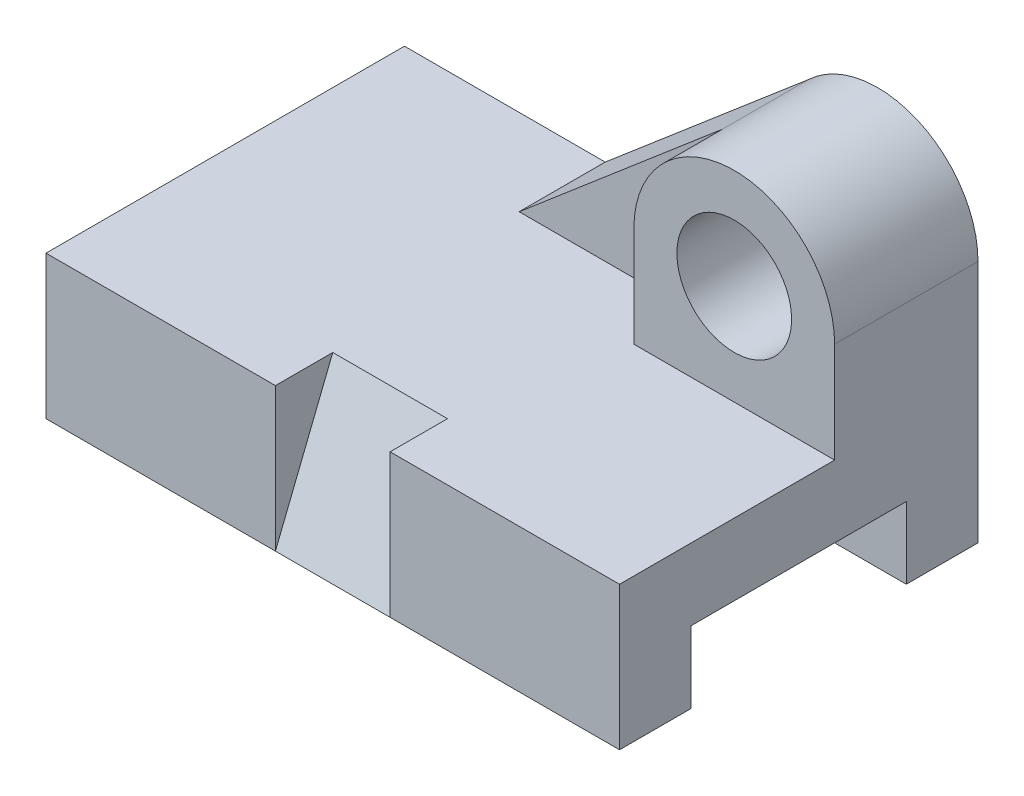
ISO-10303-21;
HEADER;
FILE_DESCRIPTION(('STEP AP214'),'2;1');
FILE_NAME('part.step','',(''),(''),'','','');
FILE_SCHEMA(('AUTOMOTIVE_DESIGN { 1 0 10303 214 1 1 1 1 }'));
ENDSEC;
DATA;
#1=APPLICATION_CONTEXT('core data for automotive mechanical design processes');
#2=APPLICATION_PROTOCOL_DEFINITION('international standard','automotive_design',2000,#1);
#3=PRODUCT_CONTEXT('',#1,'mechanical');
#4=PRODUCT('Part','Part','',(#3));
#5=PRODUCT_RELATED_PRODUCT_CATEGORY('part','',(#4));
#6=PRODUCT_DEFINITION_FORMATION('','',#4);
#7=PRODUCT_DEFINITION_CONTEXT('part definition',#1,'design');
#8=PRODUCT_DEFINITION('design','',#6,#7);
#9=PRODUCT_DEFINITION_SHAPE('','',#8);
#10=(LENGTH_UNIT() NAMED_UNIT(*) SI_UNIT(.MILLI.,.METRE.));
#11=(NAMED_UNIT(*) PLANE_ANGLE_UNIT() SI_UNIT($,.RADIAN.));
#12=(NAMED_UNIT(*) SI_UNIT($,.STERADIAN.) SOLID_ANGLE_UNIT());
#13=UNCERTAINTY_MEASURE_WITH_UNIT(LENGTH_MEASURE(1.E-05),#10,'distance_accuracy_value','');
#14=(GEOMETRIC_REPRESENTATION_CONTEXT(3) GLOBAL_UNCERTAINTY_ASSIGNED_CONTEXT((#13)) GLOBAL_UNIT_ASSIGNED_CONTEXT((#10,
#11,#12)) REPRESENTATION_CONTEXT('',''));
#15=CARTESIAN_POINT('',(0.,0.,0.));
#16=DIRECTION('',(0.,0.,1.));
#17=DIRECTION('',(1.,0.,0.));
#18=AXIS2_PLACEMENT_3D('',#15,#16,#17);
#19=CARTESIAN_POINT('',(42.0289855072463,85.,-5.07246376811594));
#20=DIRECTION('',(-1.,0.,0.));
#21=DIRECTION('',(0.,0.,1.));
#22=AXIS2_PLACEMENT_3D('',#19,#20,#21);
#23=PLANE('',#22);
#24=DIRECTION('',(0.,0.,-1.));
#25=VECTOR('',#24,1.);
#26=CARTESIAN_POINT('',(42.0289855072463,85.,-5.07246376811594));
#27=LINE('',#26,#25);
#28=CARTESIAN_POINT('',(42.0289855072463,85.,-5.07246376811594));
#29=VERTEX_POINT('',#28);
#30=CARTESIAN_POINT('',(42.0289855072463,85.,-25.0724637681159));
#31=VERTEX_POINT('',#30);
#32=EDGE_CURVE('E213',#29,#31,#27,.T.);
#33=ORIENTED_EDGE('',*,*,#32,.T.);
#34=DIRECTION('',(0.,1.,0.));
#35=VECTOR('',#34,1.);
#36=CARTESIAN_POINT('',(42.0289855072463,0.,-25.0724637681159));
#37=LINE('',#36,#35);
#38=CARTESIAN_POINT('',(42.0289855072463,50.,-25.0724637681159));
#39=VERTEX_POINT('',#38);
#40=EDGE_CURVE('E171',#39,#31,#37,.T.);
#41=ORIENTED_EDGE('',*,*,#40,.F.);
#42=DIRECTION('',(0.,0.,-1.));
#43=VECTOR('',#42,1.);
#44=CARTESIAN_POINT('',(42.0289855072463,50.,-5.07246376811594));
#45=LINE('',#44,#43);
#46=CARTESIAN_POINT('',(42.0289855072463,50.,-5.07246376811594));
#47=VERTEX_POINT('',#46);
#48=EDGE_CURVE('E183',#47,#39,#45,.T.);
#49=ORIENTED_EDGE('',*,*,#48,.F.);
#50=DIRECTION('',(0.,1.,0.));
#51=VECTOR('',#50,1.);
#52=CARTESIAN_POINT('',(42.0289855072463,85.,-5.07246376811594));
#53=LINE('',#52,#51);
#54=EDGE_CURVE('E202',#47,#29,#53,.T.);
#55=ORIENTED_EDGE('',*,*,#54,.T.);
#56=EDGE_LOOP('',(#33,#41,#49,#55));
#57=FACE_BOUND('',#56,.T.);
#58=ADVANCED_FACE('F39',(#57),#23,.T.);
#59=CARTESIAN_POINT('',(0.,50.,0.));
#60=DIRECTION('',(0.,1.,0.));
#61=DIRECTION('',(0.,0.,1.));
#62=AXIS2_PLACEMENT_3D('',#59,#60,#61);
#63=PLANE('',#62);
#64=DIRECTION('',(0.,0.,-1.));
#65=VECTOR('',#64,1.);
#66=CARTESIAN_POINT('',(-17.9710144927537,50.,-25.0724637681159));
#67=LINE('',#66,#65);
#68=CARTESIAN_POINT('',(-17.9710144927537,50.,-25.0724637681159));
#69=VERTEX_POINT('',#68);
#70=CARTESIAN_POINT('',(-17.9710144927537,50.,-55.0724637681159));
#71=VERTEX_POINT('',#70);
#72=EDGE_CURVE('E162',#69,#71,#67,.T.);
#73=ORIENTED_EDGE('',*,*,#72,.T.);
#74=DIRECTION('',(-1.,0.,0.));
#75=VECTOR('',#74,1.);
#76=CARTESIAN_POINT('',(-87.9710144927537,50.,-55.0724637681159));
#77=LINE('',#76,#75);
#78=CARTESIAN_POINT('',(-87.9710144927537,50.,-55.0724637681159));
#79=VERTEX_POINT('',#78);
#80=EDGE_CURVE('E63',#71,#79,#77,.T.);
#81=ORIENTED_EDGE('',*,*,#80,.T.);
#82=DIRECTION('',(0.,0.,1.));
#83=VECTOR('',#82,1.);
#84=CARTESIAN_POINT('',(-87.9710144927537,50.,-55.0724637681159));
#85=LINE('',#84,#83);
#86=CARTESIAN_POINT('',(-87.9710144927537,50.,69.927536231884));
#87=VERTEX_POINT('',#86);
#88=EDGE_CURVE('E262',#79,#87,#85,.T.);
#89=ORIENTED_EDGE('',*,*,#88,.T.);
#90=DIRECTION('',(1.,0.,0.));
#91=VECTOR('',#90,1.);
#92=CARTESIAN_POINT('',(-87.9710144927537,50.,69.927536231884));
#93=LINE('',#92,#91);
#94=CARTESIAN_POINT('',(-7.97101449275366,50.,69.927536231884));
#95=VERTEX_POINT('',#94);
#96=EDGE_CURVE('E90',#87,#95,#93,.T.);
#97=ORIENTED_EDGE('',*,*,#96,.T.);
#98=DIRECTION('',(0.,0.,1.));
#99=VECTOR('',#98,1.);
#100=CARTESIAN_POINT('',(-7.97101449275366,50.,49.927536231884));
#101=LINE('',#100,#99);
#102=CARTESIAN_POINT('',(-7.97101449275366,50.,49.927536231884));
#103=VERTEX_POINT('',#102);
#104=EDGE_CURVE('E233',#103,#95,#101,.T.);
#105=ORIENTED_EDGE('',*,*,#104,.F.);
#106=DIRECTION('',(-1.,0.,0.));
#107=VECTOR('',#106,1.);
#108=CARTESIAN_POINT('',(-7.97101449275366,50.,49.927536231884));
#109=LINE('',#108,#107);
#110=CARTESIAN_POINT('',(32.0289855072464,50.,49.927536231884));
#111=VERTEX_POINT('',#110);
#112=EDGE_CURVE('E226',#111,#103,#109,.T.);
#113=ORIENTED_EDGE('',*,*,#112,.F.);
#114=DIRECTION('',(0.,0.,1.));
#115=VECTOR('',#114,1.);
#116=CARTESIAN_POINT('',(32.0289855072464,50.,49.927536231884));
#117=LINE('',#116,#115);
#118=CARTESIAN_POINT('',(32.0289855072464,50.,69.927536231884));
#119=VERTEX_POINT('',#118);
#120=EDGE_CURVE('E229',#111,#119,#117,.T.);
#121=ORIENTED_EDGE('',*,*,#120,.T.);
#122=CARTESIAN_POINT('',(112.028985507246,50.,69.927536231884));
#123=VERTEX_POINT('',#122);
#124=EDGE_CURVE('E264',#119,#123,#93,.T.);
#125=ORIENTED_EDGE('',*,*,#124,.T.);
#126=DIRECTION('',(0.,0.,-1.));
#127=VECTOR('',#126,1.);
#128=CARTESIAN_POINT('',(112.028985507246,50.,-55.0724637681159));
#129=LINE('',#128,#127);
#130=CARTESIAN_POINT('',(112.028985507246,50.,-5.07246376811594));
#131=VERTEX_POINT('',#130);
#132=EDGE_CURVE('E266',#123,#131,#129,.T.);
#133=ORIENTED_EDGE('',*,*,#132,.T.);
#134=DIRECTION('',(-1.,0.,0.));
#135=VECTOR('',#134,1.);
#136=CARTESIAN_POINT('',(42.0289855072463,50.,-5.07246376811594));
#137=LINE('',#136,#135);
#138=EDGE_CURVE('E200',#131,#47,#137,.T.);
#139=ORIENTED_EDGE('',*,*,#138,.T.);
#140=ORIENTED_EDGE('',*,*,#48,.T.);
#141=DIRECTION('',(1.,0.,0.));
#142=VECTOR('',#141,1.);
#143=CARTESIAN_POINT('',(0.,50.,-25.0724637681159));
#144=LINE('',#143,#142);
#145=EDGE_CURVE('E175',#69,#39,#144,.T.);
#146=ORIENTED_EDGE('',*,*,#145,.F.);
#147=EDGE_LOOP('',(#73,#81,#89,#97,#105,#113,#121,#125,#133,#139,#140,#146));
#148=FACE_BOUND('',#147,.T.);
#149=ADVANCED_FACE('F181',(#148),#63,.T.);
#150=CARTESIAN_POINT('',(-7.97101449275366,50.,49.927536231884));
#151=DIRECTION('',(-1.,0.,0.));
#152=DIRECTION('',(0.,-1.,0.));
#153=AXIS2_PLACEMENT_3D('',#150,#151,#152);
#154=PLANE('',#153);
#155=DIRECTION('',(0.,0.928476690885259,-0.371390676354104));
#156=VECTOR('',#155,1.);
#157=CARTESIAN_POINT('',(-7.97101449275366,50.,49.927536231884));
#158=LINE('',#157,#156);
#159=CARTESIAN_POINT('',(-7.97101449275365,0.,69.927536231884));
#160=VERTEX_POINT('',#159);
#161=EDGE_CURVE('E220',#160,#103,#158,.T.);
#162=ORIENTED_EDGE('',*,*,#161,.T.);
#163=ORIENTED_EDGE('',*,*,#104,.T.);
#164=DIRECTION('',(0.,-1.,0.));
#165=VECTOR('',#164,1.);
#166=CARTESIAN_POINT('',(-7.97101449275366,50.,69.927536231884));
#167=LINE('',#166,#165);
#168=EDGE_CURVE('E223',#95,#160,#167,.T.);
#169=ORIENTED_EDGE('',*,*,#168,.T.);
#170=EDGE_LOOP('',(#162,#163,#169));
#171=FACE_BOUND('',#170,.T.);
#172=ADVANCED_FACE('F341',(#171),#154,.F.);
#173=CARTESIAN_POINT('',(32.0289855072464,50.,49.927536231884));
#174=DIRECTION('',(1.,0.,0.));
#175=DIRECTION('',(0.,0.,-1.));
#176=AXIS2_PLACEMENT_3D('',#173,#174,#175);
#177=PLANE('',#176);
#178=DIRECTION('',(0.,0.928476690885259,-0.371390676354104));
#179=VECTOR('',#178,1.);
#180=CARTESIAN_POINT('',(32.0289855072464,50.,49.927536231884));
#181=LINE('',#180,#179);
#182=CARTESIAN_POINT('',(32.0289855072464,0.,69.927536231884));
#183=VERTEX_POINT('',#182);
#184=EDGE_CURVE('E217',#183,#111,#181,.T.);
#185=ORIENTED_EDGE('',*,*,#184,.F.);
#186=DIRECTION('',(0.,1.,0.));
#187=VECTOR('',#186,1.);
#188=CARTESIAN_POINT('',(32.0289855072464,50.,69.927536231884));
#189=LINE('',#188,#187);
#190=EDGE_CURVE('E230',#183,#119,#189,.T.);
#191=ORIENTED_EDGE('',*,*,#190,.T.);
#192=ORIENTED_EDGE('',*,*,#120,.F.);
#193=EDGE_LOOP('',(#185,#191,#192));
#194=FACE_BOUND('',#193,.T.);
#195=ADVANCED_FACE('F330',(#194),#177,.F.);
#196=CARTESIAN_POINT('',(-87.9710144927537,50.,69.927536231884));
#197=DIRECTION('',(0.,0.,-1.));
#198=DIRECTION('',(-1.,0.,0.));
#199=AXIS2_PLACEMENT_3D('',#196,#197,#198);
#200=PLANE('',#199);
#201=DIRECTION('',(1.,0.,0.));
#202=VECTOR('',#201,1.);
#203=CARTESIAN_POINT('',(-87.9710144927537,0.,69.927536231884));
#204=LINE('',#203,#202);
#205=CARTESIAN_POINT('',(-87.9710144927537,0.,69.927536231884));
#206=VERTEX_POINT('',#205);
#207=EDGE_CURVE('E275',#206,#160,#204,.T.);
#208=ORIENTED_EDGE('',*,*,#207,.T.);
#209=ORIENTED_EDGE('',*,*,#168,.F.);
#210=ORIENTED_EDGE('',*,*,#96,.F.);
#211=DIRECTION('',(0.,-1.,0.));
#212=VECTOR('',#211,1.);
#213=CARTESIAN_POINT('',(-87.9710144927537,50.,69.927536231884));
#214=LINE('',#213,#212);
#215=EDGE_CURVE('E11',#87,#206,#214,.T.);
#216=ORIENTED_EDGE('',*,*,#215,.T.);
#217=EDGE_LOOP('',(#208,#209,#210,#216));
#218=FACE_BOUND('',#217,.T.);
#219=ADVANCED_FACE('F334',(#218),#200,.F.);
#220=CARTESIAN_POINT('',(0.,0.,0.));
#221=DIRECTION('',(0.,1.,0.));
#222=DIRECTION('',(0.,0.,1.));
#223=AXIS2_PLACEMENT_3D('',#220,#221,#222);
#224=PLANE('',#223);
#225=DIRECTION('',(0.,0.,-1.));
#226=VECTOR('',#225,1.);
#227=CARTESIAN_POINT('',(112.028985507246,0.,-55.0724637681159));
#228=LINE('',#227,#226);
#229=CARTESIAN_POINT('',(112.028985507246,0.,-30.0724637681159));
#230=VERTEX_POINT('',#229);
#231=CARTESIAN_POINT('',(112.028985507246,0.,-55.0724637681159));
#232=VERTEX_POINT('',#231);
#233=EDGE_CURVE('E278',#230,#232,#228,.T.);
#234=ORIENTED_EDGE('',*,*,#233,.F.);
#235=DIRECTION('',(-1.,0.,0.));
#236=VECTOR('',#235,1.);
#237=CARTESIAN_POINT('',(112.028985507246,0.,-30.0724637681159));
#238=LINE('',#237,#236);
#239=CARTESIAN_POINT('',(-87.9710144927537,0.,-30.0724637681159));
#240=VERTEX_POINT('',#239);
#241=EDGE_CURVE('E246',#230,#240,#238,.T.);
#242=ORIENTED_EDGE('',*,*,#241,.T.);
#243=DIRECTION('',(0.,0.,1.));
#244=VECTOR('',#243,1.);
#245=CARTESIAN_POINT('',(-87.9710144927537,0.,-55.0724637681159));
#246=LINE('',#245,#244);
#247=CARTESIAN_POINT('',(-87.9710144927537,0.,-55.0724637681159));
#248=VERTEX_POINT('',#247);
#249=EDGE_CURVE('E271',#248,#240,#246,.T.);
#250=ORIENTED_EDGE('',*,*,#249,.F.);
#251=DIRECTION('',(-1.,0.,0.));
#252=VECTOR('',#251,1.);
#253=CARTESIAN_POINT('',(-87.9710144927537,0.,-55.0724637681159));
#254=LINE('',#253,#252);
#255=EDGE_CURVE('E84',#232,#248,#254,.T.);
#256=ORIENTED_EDGE('',*,*,#255,.F.);
#257=EDGE_LOOP('',(#234,#242,#250,#256));
#258=FACE_BOUND('',#257,.T.);
#259=ADVANCED_FACE('F313',(#258),#224,.F.);
#260=CARTESIAN_POINT('',(-87.9710144927537,50.,-55.0724637681159));
#261=DIRECTION('',(1.,0.,0.));
#262=DIRECTION('',(0.,0.,-1.));
#263=AXIS2_PLACEMENT_3D('',#260,#261,#262);
#264=PLANE('',#263);
#265=ORIENTED_EDGE('',*,*,#249,.T.);
#266=DIRECTION('',(0.,-1.,0.));
#267=VECTOR('',#266,1.);
#268=CARTESIAN_POINT('',(-87.9710144927537,25.,-30.0724637681159));
#269=LINE('',#268,#267);
#270=CARTESIAN_POINT('',(-87.9710144927537,25.,-30.0724637681159));
#271=VERTEX_POINT('',#270);
#272=EDGE_CURVE('E235',#271,#240,#269,.T.);
#273=ORIENTED_EDGE('',*,*,#272,.F.);
#274=DIRECTION('',(0.,0.,-1.));
#275=VECTOR('',#274,1.);
#276=CARTESIAN_POINT('',(-87.9710144927537,25.,-30.0724637681159));
#277=LINE('',#276,#275);
#278=CARTESIAN_POINT('',(-87.9710144927537,25.,44.9275362318841));
#279=VERTEX_POINT('',#278);
#280=EDGE_CURVE('E241',#279,#271,#277,.T.);
#281=ORIENTED_EDGE('',*,*,#280,.F.);
#282=DIRECTION('',(0.,1.,0.));
#283=VECTOR('',#282,1.);
#284=CARTESIAN_POINT('',(-87.9710144927537,25.,44.9275362318841));
#285=LINE('',#284,#283);
#286=CARTESIAN_POINT('',(-87.9710144927537,0.,44.9275362318841));
#287=VERTEX_POINT('',#286);
#288=EDGE_CURVE('E248',#287,#279,#285,.T.);
#289=ORIENTED_EDGE('',*,*,#288,.F.);
#290=EDGE_CURVE('E255',#287,#206,#246,.T.);
#291=ORIENTED_EDGE('',*,*,#290,.T.);
#292=ORIENTED_EDGE('',*,*,#215,.F.);
#293=ORIENTED_EDGE('',*,*,#88,.F.);
#294=DIRECTION('',(0.,-1.,0.));
#295=VECTOR('',#294,1.);
#296=CARTESIAN_POINT('',(-87.9710144927537,50.,-55.0724637681159));
#297=LINE('',#296,#295);
#298=EDGE_CURVE('E270',#79,#248,#297,.T.);
#299=ORIENTED_EDGE('',*,*,#298,.T.);
#300=EDGE_LOOP('',(#265,#273,#281,#289,#291,#292,#293,#299));
#301=FACE_BOUND('',#300,.T.);
#302=ADVANCED_FACE('F41',(#301),#264,.F.);
#303=ORIENTED_EDGE('',*,*,#124,.F.);
#304=ORIENTED_EDGE('',*,*,#190,.F.);
#305=CARTESIAN_POINT('',(112.028985507246,0.,69.927536231884));
#306=VERTEX_POINT('',#305);
#307=EDGE_CURVE('E274',#183,#306,#204,.T.);
#308=ORIENTED_EDGE('',*,*,#307,.T.);
#309=DIRECTION('',(0.,-1.,0.));
#310=VECTOR('',#309,1.);
#311=CARTESIAN_POINT('',(112.028985507246,50.,69.927536231884));
#312=LINE('',#311,#310);
#313=EDGE_CURVE('E47',#123,#306,#312,.T.);
#314=ORIENTED_EDGE('',*,*,#313,.F.);
#315=EDGE_LOOP('',(#303,#304,#308,#314));
#316=FACE_BOUND('',#315,.T.);
#317=ADVANCED_FACE('F328',(#316),#200,.F.);
#318=CARTESIAN_POINT('',(112.028985507246,50.,-55.0724637681159));
#319=DIRECTION('',(-1.,0.,0.));
#320=DIRECTION('',(0.,0.,1.));
#321=AXIS2_PLACEMENT_3D('',#318,#319,#320);
#322=PLANE('',#321);
#323=DIRECTION('',(0.,0.,-1.));
#324=VECTOR('',#323,1.);
#325=CARTESIAN_POINT('',(112.028985507246,25.,-30.0724637681159));
#326=LINE('',#325,#324);
#327=CARTESIAN_POINT('',(112.028985507246,25.,44.9275362318841));
#328=VERTEX_POINT('',#327);
#329=CARTESIAN_POINT('',(112.028985507246,25.,-30.0724637681159));
#330=VERTEX_POINT('',#329);
#331=EDGE_CURVE('E243',#328,#330,#326,.T.);
#332=ORIENTED_EDGE('',*,*,#331,.T.);
#333=DIRECTION('',(0.,-1.,0.));
#334=VECTOR('',#333,1.);
#335=CARTESIAN_POINT('',(112.028985507246,25.,-30.0724637681159));
#336=LINE('',#335,#334);
#337=EDGE_CURVE('E238',#330,#230,#336,.T.);
#338=ORIENTED_EDGE('',*,*,#337,.T.);
#339=ORIENTED_EDGE('',*,*,#233,.T.);
#340=DIRECTION('',(0.,-1.,0.));
#341=VECTOR('',#340,1.);
#342=CARTESIAN_POINT('',(112.028985507246,50.,-55.0724637681159));
#343=LINE('',#342,#341);
#344=CARTESIAN_POINT('',(112.028985507246,85.,-55.0724637681159));
#345=VERTEX_POINT('',#344);
#346=EDGE_CURVE('E284',#345,#232,#343,.T.);
#347=ORIENTED_EDGE('',*,*,#346,.F.);
#348=DIRECTION('',(0.,0.,-1.));
#349=VECTOR('',#348,1.);
#350=CARTESIAN_POINT('',(112.028985507246,85.,-5.07246376811594));
#351=LINE('',#350,#349);
#352=CARTESIAN_POINT('',(112.028985507246,85.,-5.07246376811594));
#353=VERTEX_POINT('',#352);
#354=EDGE_CURVE('E209',#353,#345,#351,.T.);
#355=ORIENTED_EDGE('',*,*,#354,.F.);
#356=DIRECTION('',(0.,-1.,0.));
#357=VECTOR('',#356,1.);
#358=CARTESIAN_POINT('',(112.028985507246,50.,-5.07246376811594));
#359=LINE('',#358,#357);
#360=EDGE_CURVE('E197',#353,#131,#359,.T.);
#361=ORIENTED_EDGE('',*,*,#360,.T.);
#362=ORIENTED_EDGE('',*,*,#132,.F.);
#363=ORIENTED_EDGE('',*,*,#313,.T.);
#364=CARTESIAN_POINT('',(112.028985507246,0.,44.9275362318841));
#365=VERTEX_POINT('',#364);
#366=EDGE_CURVE('E279',#306,#365,#228,.T.);
#367=ORIENTED_EDGE('',*,*,#366,.T.);
#368=DIRECTION('',(0.,1.,0.));
#369=VECTOR('',#368,1.);
#370=CARTESIAN_POINT('',(112.028985507246,25.,44.9275362318841));
#371=LINE('',#370,#369);
#372=EDGE_CURVE('E54',#365,#328,#371,.T.);
#373=ORIENTED_EDGE('',*,*,#372,.T.);
#374=EDGE_LOOP('',(#332,#338,#339,#347,#355,#361,#362,#363,#367,#373));
#375=FACE_BOUND('',#374,.T.);
#376=ADVANCED_FACE('F290',(#375),#322,.F.);
#377=CARTESIAN_POINT('',(-87.9710144927537,50.,-55.0724637681159));
#378=DIRECTION('',(0.,0.,1.));
#379=DIRECTION('',(1.,0.,0.));
#380=AXIS2_PLACEMENT_3D('',#377,#378,#379);
#381=PLANE('',#380);
#382=ORIENTED_EDGE('',*,*,#80,.F.);
#383=DIRECTION('',(0.761336929807657,0.648356444643724,0.));
#384=VECTOR('',#383,1.);
#385=CARTESIAN_POINT('',(-32.235290152864,37.8525069646318,-55.0724637681159));
#386=LINE('',#385,#384);
#387=CARTESIAN_POINT('',(52.9059078591443,110.358965372894,-55.0724637681159));
#388=VERTEX_POINT('',#387);
#389=EDGE_CURVE('E168',#71,#388,#386,.T.);
#390=ORIENTED_EDGE('',*,*,#389,.T.);
#391=CARTESIAN_POINT('',(77.0289855072463,85.,-55.0724637681159));
#392=DIRECTION('',(0.,0.,-1.));
#393=DIRECTION('',(1.,0.,0.));
#394=AXIS2_PLACEMENT_3D('',#391,#392,#393);
#395=CIRCLE('',#394,35.);
#396=EDGE_CURVE('E194',#388,#345,#395,.T.);
#397=ORIENTED_EDGE('',*,*,#396,.T.);
#398=ORIENTED_EDGE('',*,*,#346,.T.);
#399=ORIENTED_EDGE('',*,*,#255,.T.);
#400=ORIENTED_EDGE('',*,*,#298,.F.);
#401=EDGE_LOOP('',(#382,#390,#397,#398,#399,#400));
#402=FACE_BOUND('',#401,.T.);
#403=CARTESIAN_POINT('',(77.0289855072463,85.,-55.0724637681159));
#404=DIRECTION('',(0.,0.,-1.));
#405=DIRECTION('',(-1.,0.,0.));
#406=AXIS2_PLACEMENT_3D('',#403,#404,#405);
#407=CIRCLE('',#406,20.);
#408=CARTESIAN_POINT('',(57.0289855072463,85.,-55.0724637681159));
#409=VERTEX_POINT('',#408);
#410=EDGE_CURVE('E189',#409,#409,#407,.T.);
#411=ORIENTED_EDGE('',*,*,#410,.F.);
#412=EDGE_LOOP('',(#411));
#413=FACE_BOUND('',#412,.T.);
#414=ADVANCED_FACE('F316',(#402,#413),#381,.F.);
#415=DIRECTION('',(1.,0.,0.));
#416=VECTOR('',#415,1.);
#417=CARTESIAN_POINT('',(-61.8226625640987,0.,69.927536231884));
#418=LINE('',#417,#416);
#419=EDGE_CURVE('E212',#160,#183,#418,.T.);
#420=ORIENTED_EDGE('',*,*,#419,.F.);
#421=ORIENTED_EDGE('',*,*,#207,.F.);
#422=ORIENTED_EDGE('',*,*,#290,.F.);
#423=DIRECTION('',(-1.,0.,0.));
#424=VECTOR('',#423,1.);
#425=CARTESIAN_POINT('',(112.028985507246,0.,44.9275362318841));
#426=LINE('',#425,#424);
#427=EDGE_CURVE('E258',#365,#287,#426,.T.);
#428=ORIENTED_EDGE('',*,*,#427,.F.);
#429=ORIENTED_EDGE('',*,*,#366,.F.);
#430=ORIENTED_EDGE('',*,*,#307,.F.);
#431=EDGE_LOOP('',(#420,#421,#422,#428,#429,#430));
#432=FACE_BOUND('',#431,.T.);
#433=ADVANCED_FACE('F296',(#432),#224,.F.);
#434=CARTESIAN_POINT('',(112.028985507246,25.,-30.0724637681159));
#435=DIRECTION('',(0.,0.,-1.));
#436=DIRECTION('',(0.,1.,0.));
#437=AXIS2_PLACEMENT_3D('',#434,#435,#436);
#438=PLANE('',#437);
#439=ORIENTED_EDGE('',*,*,#272,.T.);
#440=ORIENTED_EDGE('',*,*,#241,.F.);
#441=ORIENTED_EDGE('',*,*,#337,.F.);
#442=DIRECTION('',(-1.,0.,0.));
#443=VECTOR('',#442,1.);
#444=CARTESIAN_POINT('',(112.028985507246,25.,-30.0724637681159));
#445=LINE('',#444,#443);
#446=EDGE_CURVE('E253',#330,#271,#445,.T.);
#447=ORIENTED_EDGE('',*,*,#446,.T.);
#448=EDGE_LOOP('',(#439,#440,#441,#447));
#449=FACE_BOUND('',#448,.T.);
#450=ADVANCED_FACE('F362',(#449),#438,.F.);
#451=CARTESIAN_POINT('',(112.028985507246,25.,-30.0724637681159));
#452=DIRECTION('',(0.,1.,0.));
#453=DIRECTION('',(0.,0.,1.));
#454=AXIS2_PLACEMENT_3D('',#451,#452,#453);
#455=PLANE('',#454);
#456=ORIENTED_EDGE('',*,*,#280,.T.);
#457=ORIENTED_EDGE('',*,*,#446,.F.);
#458=ORIENTED_EDGE('',*,*,#331,.F.);
#459=DIRECTION('',(-1.,0.,0.));
#460=VECTOR('',#459,1.);
#461=CARTESIAN_POINT('',(112.028985507246,25.,44.9275362318841));
#462=LINE('',#461,#460);
#463=EDGE_CURVE('E256',#328,#279,#462,.T.);
#464=ORIENTED_EDGE('',*,*,#463,.T.);
#465=EDGE_LOOP('',(#456,#457,#458,#464));
#466=FACE_BOUND('',#465,.T.);
#467=ADVANCED_FACE('F306',(#466),#455,.F.);
#468=CARTESIAN_POINT('',(112.028985507246,25.,44.9275362318841));
#469=DIRECTION('',(0.,0.,1.));
#470=DIRECTION('',(0.,-1.,0.));
#471=AXIS2_PLACEMENT_3D('',#468,#469,#470);
#472=PLANE('',#471);
#473=ORIENTED_EDGE('',*,*,#288,.T.);
#474=ORIENTED_EDGE('',*,*,#463,.F.);
#475=ORIENTED_EDGE('',*,*,#372,.F.);
#476=ORIENTED_EDGE('',*,*,#427,.T.);
#477=EDGE_LOOP('',(#473,#474,#475,#476));
#478=FACE_BOUND('',#477,.T.);
#479=ADVANCED_FACE('F300',(#478),#472,.F.);
#480=CARTESIAN_POINT('',(-61.8226625640987,50.,49.927536231884));
#481=DIRECTION('',(0.,-0.371390676354104,-0.928476690885259));
#482=DIRECTION('',(0.,0.928476690885259,-0.371390676354104));
#483=AXIS2_PLACEMENT_3D('',#480,#481,#482);
#484=PLANE('',#483);
#485=ORIENTED_EDGE('',*,*,#161,.F.);
#486=ORIENTED_EDGE('',*,*,#419,.T.);
#487=ORIENTED_EDGE('',*,*,#184,.T.);
#488=ORIENTED_EDGE('',*,*,#112,.T.);
#489=EDGE_LOOP('',(#485,#486,#487,#488));
#490=FACE_BOUND('',#489,.T.);
#491=ADVANCED_FACE('F333',(#490),#484,.F.);
#492=CARTESIAN_POINT('',(77.0289855072463,85.,-5.07246376811594));
#493=DIRECTION('',(0.,0.,-1.));
#494=DIRECTION('',(-1.,0.,0.));
#495=AXIS2_PLACEMENT_3D('',#492,#493,#494);
#496=CYLINDRICAL_SURFACE('',#495,35.);
#497=DIRECTION('',(0.,0.,-1.));
#498=VECTOR('',#497,1.);
#499=CARTESIAN_POINT('',(52.9059078591443,110.358965372894,-25.0724637681159));
#500=LINE('',#499,#498);
#501=CARTESIAN_POINT('',(52.9059078591443,110.358965372894,-25.0724637681159));
#502=VERTEX_POINT('',#501);
#503=EDGE_CURVE('E170',#502,#388,#500,.T.);
#504=ORIENTED_EDGE('',*,*,#503,.F.);
#505=CARTESIAN_POINT('',(77.0289855072463,85.,-25.0724637681159));
#506=DIRECTION('',(0.,0.,-1.));
#507=DIRECTION('',(-1.,0.,0.));
#508=AXIS2_PLACEMENT_3D('',#505,#506,#507);
#509=CIRCLE('',#508,35.);
#510=EDGE_CURVE('E178',#31,#502,#509,.T.);
#511=ORIENTED_EDGE('',*,*,#510,.F.);
#512=ORIENTED_EDGE('',*,*,#32,.F.);
#513=CARTESIAN_POINT('',(77.0289855072463,85.,-5.07246376811594));
#514=DIRECTION('',(0.,0.,-1.));
#515=DIRECTION('',(1.,0.,0.));
#516=AXIS2_PLACEMENT_3D('',#513,#514,#515);
#517=CIRCLE('',#516,35.);
#518=EDGE_CURVE('E205',#29,#353,#517,.T.);
#519=ORIENTED_EDGE('',*,*,#518,.T.);
#520=ORIENTED_EDGE('',*,*,#354,.T.);
#521=ORIENTED_EDGE('',*,*,#396,.F.);
#522=EDGE_LOOP('',(#504,#511,#512,#519,#520,#521));
#523=FACE_BOUND('',#522,.T.);
#524=ADVANCED_FACE('F320',(#523),#496,.T.);
#525=CARTESIAN_POINT('',(77.0289855072463,85.,-5.07246376811594));
#526=DIRECTION('',(0.,0.,1.));
#527=DIRECTION('',(1.,0.,0.));
#528=AXIS2_PLACEMENT_3D('',#525,#526,#527);
#529=PLANE('',#528);
#530=CARTESIAN_POINT('',(77.0289855072463,85.,-5.07246376811594));
#531=DIRECTION('',(0.,0.,-1.));
#532=DIRECTION('',(-1.,0.,0.));
#533=AXIS2_PLACEMENT_3D('',#530,#531,#532);
#534=CIRCLE('',#533,20.);
#535=CARTESIAN_POINT('',(57.0289855072463,85.,-5.07246376811594));
#536=VERTEX_POINT('',#535);
#537=EDGE_CURVE('E191',#536,#536,#534,.T.);
#538=ORIENTED_EDGE('',*,*,#537,.T.);
#539=EDGE_LOOP('',(#538));
#540=FACE_BOUND('',#539,.T.);
#541=ORIENTED_EDGE('',*,*,#360,.F.);
#542=ORIENTED_EDGE('',*,*,#518,.F.);
#543=ORIENTED_EDGE('',*,*,#54,.F.);
#544=ORIENTED_EDGE('',*,*,#138,.F.);
#545=EDGE_LOOP('',(#541,#542,#543,#544));
#546=FACE_BOUND('',#545,.T.);
#547=ADVANCED_FACE('F324',(#540,#546),#529,.T.);
#548=CARTESIAN_POINT('',(77.0289855072463,85.,-5.07246376811594));
#549=DIRECTION('',(0.,0.,-1.));
#550=DIRECTION('',(-1.,0.,0.));
#551=AXIS2_PLACEMENT_3D('',#548,#549,#550);
#552=CYLINDRICAL_SURFACE('',#551,20.);
#553=ORIENTED_EDGE('',*,*,#537,.F.);
#554=EDGE_LOOP('',(#553));
#555=FACE_BOUND('',#554,.T.);
#556=ORIENTED_EDGE('',*,*,#410,.T.);
#557=EDGE_LOOP('',(#556));
#558=FACE_BOUND('',#557,.T.);
#559=ADVANCED_FACE('F414',(#555,#558),#552,.F.);
#560=CARTESIAN_POINT('',(-32.235290152864,37.8525069646318,-25.0724637681159));
#561=DIRECTION('',(-0.648356444643724,0.761336929807657,0.));
#562=DIRECTION('',(-0.761336929807658,-0.648356444643724,0.));
#563=AXIS2_PLACEMENT_3D('',#560,#561,#562);
#564=PLANE('',#563);
#565=ORIENTED_EDGE('',*,*,#389,.F.);
#566=ORIENTED_EDGE('',*,*,#72,.F.);
#567=DIRECTION('',(0.761336929807657,0.648356444643724,0.));
#568=VECTOR('',#567,1.);
#569=CARTESIAN_POINT('',(-32.235290152864,37.8525069646318,-25.0724637681159));
#570=LINE('',#569,#568);
#571=EDGE_CURVE('E165',#69,#502,#570,.T.);
#572=ORIENTED_EDGE('',*,*,#571,.T.);
#573=ORIENTED_EDGE('',*,*,#503,.T.);
#574=EDGE_LOOP('',(#565,#566,#572,#573));
#575=FACE_BOUND('',#574,.T.);
#576=ADVANCED_FACE('F164',(#575),#564,.T.);
#577=CARTESIAN_POINT('',(0.,0.,-25.0724637681159));
#578=DIRECTION('',(0.,0.,-1.));
#579=DIRECTION('',(-1.,0.,0.));
#580=AXIS2_PLACEMENT_3D('',#577,#578,#579);
#581=PLANE('',#580);
#582=ORIENTED_EDGE('',*,*,#145,.T.);
#583=ORIENTED_EDGE('',*,*,#40,.T.);
#584=ORIENTED_EDGE('',*,*,#510,.T.);
#585=ORIENTED_EDGE('',*,*,#571,.F.);
#586=EDGE_LOOP('',(#582,#583,#584,#585));
#587=FACE_BOUND('',#586,.T.);
#588=ADVANCED_FACE('F174',(#587),#581,.F.);
#589=CLOSED_SHELL('',(#58,#149,#172,#195,#219,#259,#302,#317,#376,#414,#433,#450,#467,#479,#491,
#524,#547,#559,#576,#588));
#590=MANIFOLD_SOLID_BREP('B2',#589);
#591=ADVANCED_BREP_SHAPE_REPRESENTATION('',(#18,#590),#14);
#592=SHAPE_DEFINITION_REPRESENTATION(#9,#591);
ENDSEC;
END-ISO-10303-21;
